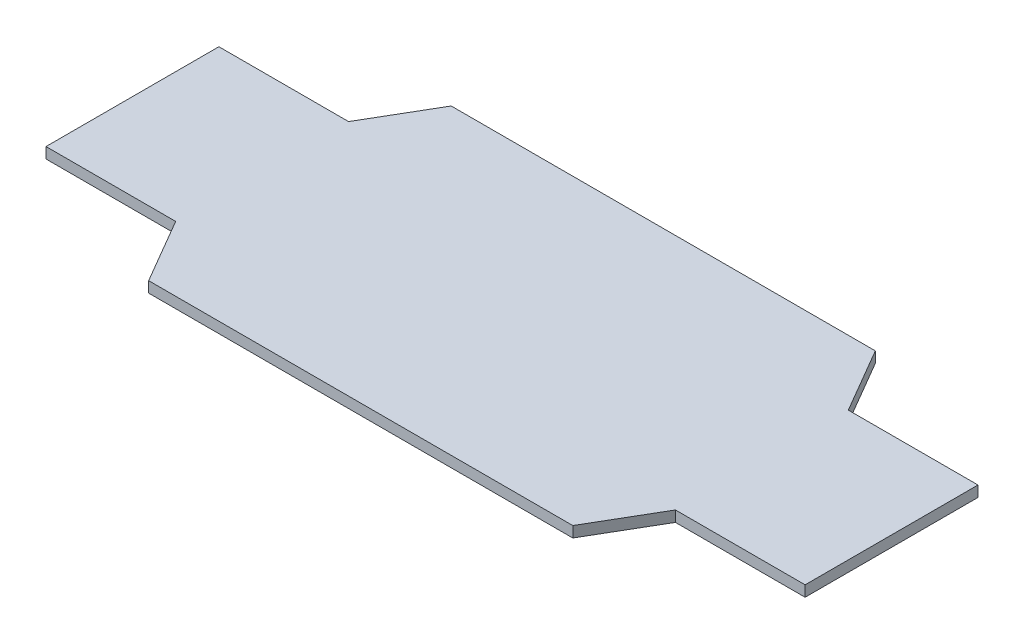
ISO-10303-21;
HEADER;
FILE_DESCRIPTION(('STEP AP214'),'2;1');
FILE_NAME('part.step','',(''),(''),'','','');
FILE_SCHEMA(('AUTOMOTIVE_DESIGN { 1 0 10303 214 1 1 1 1 }'));
ENDSEC;
DATA;
#1=APPLICATION_CONTEXT('core data for automotive mechanical design processes');
#2=APPLICATION_PROTOCOL_DEFINITION('international standard','automotive_design',2000,#1);
#3=PRODUCT_CONTEXT('',#1,'mechanical');
#4=PRODUCT('Part','Part','',(#3));
#5=PRODUCT_RELATED_PRODUCT_CATEGORY('part','',(#4));
#6=PRODUCT_DEFINITION_FORMATION('','',#4);
#7=PRODUCT_DEFINITION_CONTEXT('part definition',#1,'design');
#8=PRODUCT_DEFINITION('design','',#6,#7);
#9=PRODUCT_DEFINITION_SHAPE('','',#8);
#10=(LENGTH_UNIT() NAMED_UNIT(*) SI_UNIT(.MILLI.,.METRE.));
#11=(NAMED_UNIT(*) PLANE_ANGLE_UNIT() SI_UNIT($,.RADIAN.));
#12=(NAMED_UNIT(*) SI_UNIT($,.STERADIAN.) SOLID_ANGLE_UNIT());
#13=UNCERTAINTY_MEASURE_WITH_UNIT(LENGTH_MEASURE(1.E-05),#10,'distance_accuracy_value','');
#14=(GEOMETRIC_REPRESENTATION_CONTEXT(3) GLOBAL_UNCERTAINTY_ASSIGNED_CONTEXT((#13)) GLOBAL_UNIT_ASSIGNED_CONTEXT((#10,
#11,#12)) REPRESENTATION_CONTEXT('',''));
#15=CARTESIAN_POINT('',(0.,0.,0.));
#16=DIRECTION('',(0.,0.,1.));
#17=DIRECTION('',(1.,0.,0.));
#18=AXIS2_PLACEMENT_3D('',#15,#16,#17);
#19=CARTESIAN_POINT('',(0.,5.08,40.64));
#20=DIRECTION('',(0.,0.,-1.));
#21=DIRECTION('',(-1.,0.,0.));
#22=AXIS2_PLACEMENT_3D('',#19,#20,#21);
#23=PLANE('',#22);
#24=DIRECTION('',(1.,0.,0.));
#25=VECTOR('',#24,1.);
#26=CARTESIAN_POINT('',(0.,0.,40.64));
#27=LINE('',#26,#25);
#28=CARTESIAN_POINT('',(117.475,0.,40.64));
#29=VERTEX_POINT('',#28);
#30=CARTESIAN_POINT('',(178.435,0.,40.64));
#31=VERTEX_POINT('',#30);
#32=EDGE_CURVE('E172',#29,#31,#27,.T.);
#33=ORIENTED_EDGE('',*,*,#32,.T.);
#34=DIRECTION('',(0.,-1.,0.));
#35=VECTOR('',#34,1.);
#36=CARTESIAN_POINT('',(178.435,5.08,40.64));
#37=LINE('',#36,#35);
#38=CARTESIAN_POINT('',(178.435,5.08,40.64));
#39=VERTEX_POINT('',#38);
#40=EDGE_CURVE('E11',#39,#31,#37,.T.);
#41=ORIENTED_EDGE('',*,*,#40,.F.);
#42=DIRECTION('',(1.,0.,0.));
#43=VECTOR('',#42,1.);
#44=CARTESIAN_POINT('',(0.,5.08,40.64));
#45=LINE('',#44,#43);
#46=CARTESIAN_POINT('',(117.475,5.08,40.64));
#47=VERTEX_POINT('',#46);
#48=EDGE_CURVE('E206',#47,#39,#45,.T.);
#49=ORIENTED_EDGE('',*,*,#48,.F.);
#50=DIRECTION('',(0.,-1.,0.));
#51=VECTOR('',#50,1.);
#52=CARTESIAN_POINT('',(117.475,5.08,40.64));
#53=LINE('',#52,#51);
#54=EDGE_CURVE('E168',#47,#29,#53,.T.);
#55=ORIENTED_EDGE('',*,*,#54,.T.);
#56=EDGE_LOOP('',(#33,#41,#49,#55));
#57=FACE_BOUND('',#56,.T.);
#58=ADVANCED_FACE('F47',(#57),#23,.F.);
#59=CARTESIAN_POINT('',(178.435,5.08,0.));
#60=DIRECTION('',(-1.,0.,0.));
#61=DIRECTION('',(0.,0.,1.));
#62=AXIS2_PLACEMENT_3D('',#59,#60,#61);
#63=PLANE('',#62);
#64=DIRECTION('',(0.,0.,-1.));
#65=VECTOR('',#64,1.);
#66=CARTESIAN_POINT('',(178.435,0.,0.));
#67=LINE('',#66,#65);
#68=CARTESIAN_POINT('',(178.435,0.,-40.64));
#69=VERTEX_POINT('',#68);
#70=EDGE_CURVE('E176',#31,#69,#67,.T.);
#71=ORIENTED_EDGE('',*,*,#70,.T.);
#72=DIRECTION('',(0.,-1.,0.));
#73=VECTOR('',#72,1.);
#74=CARTESIAN_POINT('',(178.435,5.08,-40.64));
#75=LINE('',#74,#73);
#76=CARTESIAN_POINT('',(178.435,5.08,-40.64));
#77=VERTEX_POINT('',#76);
#78=EDGE_CURVE('E56',#77,#69,#75,.T.);
#79=ORIENTED_EDGE('',*,*,#78,.F.);
#80=DIRECTION('',(0.,0.,-1.));
#81=VECTOR('',#80,1.);
#82=CARTESIAN_POINT('',(178.435,5.08,0.));
#83=LINE('',#82,#81);
#84=EDGE_CURVE('E119',#39,#77,#83,.T.);
#85=ORIENTED_EDGE('',*,*,#84,.F.);
#86=ORIENTED_EDGE('',*,*,#40,.T.);
#87=EDGE_LOOP('',(#71,#79,#85,#86));
#88=FACE_BOUND('',#87,.T.);
#89=ADVANCED_FACE('F300',(#88),#63,.F.);
#90=CARTESIAN_POINT('',(0.,5.08,-40.64));
#91=DIRECTION('',(0.,0.,1.));
#92=DIRECTION('',(1.,0.,0.));
#93=AXIS2_PLACEMENT_3D('',#90,#91,#92);
#94=PLANE('',#93);
#95=DIRECTION('',(-1.,0.,0.));
#96=VECTOR('',#95,1.);
#97=CARTESIAN_POINT('',(0.,0.,-40.64));
#98=LINE('',#97,#96);
#99=CARTESIAN_POINT('',(117.475,0.,-40.64));
#100=VERTEX_POINT('',#99);
#101=EDGE_CURVE('E179',#69,#100,#98,.T.);
#102=ORIENTED_EDGE('',*,*,#101,.T.);
#103=DIRECTION('',(0.,-1.,0.));
#104=VECTOR('',#103,1.);
#105=CARTESIAN_POINT('',(117.475,5.08,-40.64));
#106=LINE('',#105,#104);
#107=CARTESIAN_POINT('',(117.475,5.08,-40.64));
#108=VERTEX_POINT('',#107);
#109=EDGE_CURVE('E233',#108,#100,#106,.T.);
#110=ORIENTED_EDGE('',*,*,#109,.F.);
#111=DIRECTION('',(-1.,0.,0.));
#112=VECTOR('',#111,1.);
#113=CARTESIAN_POINT('',(0.,5.08,-40.64));
#114=LINE('',#113,#112);
#115=EDGE_CURVE('E243',#77,#108,#114,.T.);
#116=ORIENTED_EDGE('',*,*,#115,.F.);
#117=ORIENTED_EDGE('',*,*,#78,.T.);
#118=EDGE_LOOP('',(#102,#110,#116,#117));
#119=FACE_BOUND('',#118,.T.);
#120=ADVANCED_FACE('F241',(#119),#94,.F.);
#121=CARTESIAN_POINT('',(105.337616580311,5.08,-61.4469430051814));
#122=DIRECTION('',(-0.863778900898433,0.,0.503871025524086));
#123=DIRECTION('',(0.503871025524086,0.,0.863778900898433));
#124=AXIS2_PLACEMENT_3D('',#121,#122,#123);
#125=PLANE('',#124);
#126=DIRECTION('',(-0.503871025524086,0.,-0.863778900898433));
#127=VECTOR('',#126,1.);
#128=CARTESIAN_POINT('',(105.337616580311,0.,-61.4469430051814));
#129=LINE('',#128,#127);
#130=CARTESIAN_POINT('',(99.695,0.,-71.12));
#131=VERTEX_POINT('',#130);
#132=EDGE_CURVE('E182',#100,#131,#129,.T.);
#133=ORIENTED_EDGE('',*,*,#132,.T.);
#134=DIRECTION('',(0.,-1.,0.));
#135=VECTOR('',#134,1.);
#136=CARTESIAN_POINT('',(99.695,5.08,-71.12));
#137=LINE('',#136,#135);
#138=CARTESIAN_POINT('',(99.695,5.08,-71.12));
#139=VERTEX_POINT('',#138);
#140=EDGE_CURVE('E229',#139,#131,#137,.T.);
#141=ORIENTED_EDGE('',*,*,#140,.F.);
#142=DIRECTION('',(-0.503871025524086,0.,-0.863778900898433));
#143=VECTOR('',#142,1.);
#144=CARTESIAN_POINT('',(105.337616580311,5.08,-61.4469430051814));
#145=LINE('',#144,#143);
#146=EDGE_CURVE('E262',#108,#139,#145,.T.);
#147=ORIENTED_EDGE('',*,*,#146,.F.);
#148=ORIENTED_EDGE('',*,*,#109,.T.);
#149=EDGE_LOOP('',(#133,#141,#147,#148));
#150=FACE_BOUND('',#149,.T.);
#151=ADVANCED_FACE('F252',(#150),#125,.F.);
#152=CARTESIAN_POINT('',(0.,5.08,-71.12));
#153=DIRECTION('',(0.,0.,1.));
#154=DIRECTION('',(1.,0.,0.));
#155=AXIS2_PLACEMENT_3D('',#152,#153,#154);
#156=PLANE('',#155);
#157=DIRECTION('',(-1.,0.,0.));
#158=VECTOR('',#157,1.);
#159=CARTESIAN_POINT('',(0.,0.,-71.12));
#160=LINE('',#159,#158);
#161=CARTESIAN_POINT('',(-99.695,0.,-71.12));
#162=VERTEX_POINT('',#161);
#163=EDGE_CURVE('E185',#131,#162,#160,.T.);
#164=ORIENTED_EDGE('',*,*,#163,.T.);
#165=DIRECTION('',(0.,-1.,0.));
#166=VECTOR('',#165,1.);
#167=CARTESIAN_POINT('',(-99.695,5.08,-71.12));
#168=LINE('',#167,#166);
#169=CARTESIAN_POINT('',(-99.695,5.08,-71.12));
#170=VERTEX_POINT('',#169);
#171=EDGE_CURVE('E225',#170,#162,#168,.T.);
#172=ORIENTED_EDGE('',*,*,#171,.F.);
#173=DIRECTION('',(-1.,0.,0.));
#174=VECTOR('',#173,1.);
#175=CARTESIAN_POINT('',(0.,5.08,-71.12));
#176=LINE('',#175,#174);
#177=EDGE_CURVE('E258',#139,#170,#176,.T.);
#178=ORIENTED_EDGE('',*,*,#177,.F.);
#179=ORIENTED_EDGE('',*,*,#140,.T.);
#180=EDGE_LOOP('',(#164,#172,#178,#179));
#181=FACE_BOUND('',#180,.T.);
#182=ADVANCED_FACE('F256',(#181),#156,.F.);
#183=CARTESIAN_POINT('',(-105.337616580311,5.08,-61.4469430051814));
#184=DIRECTION('',(0.863778900898433,0.,0.503871025524086));
#185=DIRECTION('',(0.503871025524086,0.,-0.863778900898433));
#186=AXIS2_PLACEMENT_3D('',#183,#184,#185);
#187=PLANE('',#186);
#188=DIRECTION('',(-0.503871025524086,0.,0.863778900898433));
#189=VECTOR('',#188,1.);
#190=CARTESIAN_POINT('',(-105.337616580311,0.,-61.4469430051814));
#191=LINE('',#190,#189);
#192=CARTESIAN_POINT('',(-117.475,0.,-40.64));
#193=VERTEX_POINT('',#192);
#194=EDGE_CURVE('E188',#162,#193,#191,.T.);
#195=ORIENTED_EDGE('',*,*,#194,.T.);
#196=DIRECTION('',(0.,-1.,0.));
#197=VECTOR('',#196,1.);
#198=CARTESIAN_POINT('',(-117.475,5.08,-40.64));
#199=LINE('',#198,#197);
#200=CARTESIAN_POINT('',(-117.475,5.08,-40.64));
#201=VERTEX_POINT('',#200);
#202=EDGE_CURVE('E221',#201,#193,#199,.T.);
#203=ORIENTED_EDGE('',*,*,#202,.F.);
#204=DIRECTION('',(-0.503871025524086,0.,0.863778900898433));
#205=VECTOR('',#204,1.);
#206=CARTESIAN_POINT('',(-105.337616580311,5.08,-61.4469430051814));
#207=LINE('',#206,#205);
#208=EDGE_CURVE('E261',#170,#201,#207,.T.);
#209=ORIENTED_EDGE('',*,*,#208,.F.);
#210=ORIENTED_EDGE('',*,*,#171,.T.);
#211=EDGE_LOOP('',(#195,#203,#209,#210));
#212=FACE_BOUND('',#211,.T.);
#213=ADVANCED_FACE('F313',(#212),#187,.F.);
#214=CARTESIAN_POINT('',(0.,5.08,-40.64));
#215=DIRECTION('',(0.,0.,1.));
#216=DIRECTION('',(1.,0.,0.));
#217=AXIS2_PLACEMENT_3D('',#214,#215,#216);
#218=PLANE('',#217);
#219=DIRECTION('',(-1.,0.,0.));
#220=VECTOR('',#219,1.);
#221=CARTESIAN_POINT('',(0.,0.,-40.64));
#222=LINE('',#221,#220);
#223=CARTESIAN_POINT('',(-178.435,0.,-40.64));
#224=VERTEX_POINT('',#223);
#225=EDGE_CURVE('E191',#193,#224,#222,.T.);
#226=ORIENTED_EDGE('',*,*,#225,.T.);
#227=DIRECTION('',(0.,-1.,0.));
#228=VECTOR('',#227,1.);
#229=CARTESIAN_POINT('',(-178.435,5.08,-40.64));
#230=LINE('',#229,#228);
#231=CARTESIAN_POINT('',(-178.435,5.08,-40.64));
#232=VERTEX_POINT('',#231);
#233=EDGE_CURVE('E217',#232,#224,#230,.T.);
#234=ORIENTED_EDGE('',*,*,#233,.F.);
#235=DIRECTION('',(-1.,0.,0.));
#236=VECTOR('',#235,1.);
#237=CARTESIAN_POINT('',(0.,5.08,-40.64));
#238=LINE('',#237,#236);
#239=EDGE_CURVE('E266',#201,#232,#238,.T.);
#240=ORIENTED_EDGE('',*,*,#239,.F.);
#241=ORIENTED_EDGE('',*,*,#202,.T.);
#242=EDGE_LOOP('',(#226,#234,#240,#241));
#243=FACE_BOUND('',#242,.T.);
#244=ADVANCED_FACE('F316',(#243),#218,.F.);
#245=CARTESIAN_POINT('',(-178.435,5.08,0.));
#246=DIRECTION('',(1.,0.,0.));
#247=DIRECTION('',(0.,0.,-1.));
#248=AXIS2_PLACEMENT_3D('',#245,#246,#247);
#249=PLANE('',#248);
#250=DIRECTION('',(0.,0.,1.));
#251=VECTOR('',#250,1.);
#252=CARTESIAN_POINT('',(-178.435,0.,0.));
#253=LINE('',#252,#251);
#254=CARTESIAN_POINT('',(-178.435,0.,40.64));
#255=VERTEX_POINT('',#254);
#256=EDGE_CURVE('E194',#224,#255,#253,.T.);
#257=ORIENTED_EDGE('',*,*,#256,.T.);
#258=DIRECTION('',(0.,-1.,0.));
#259=VECTOR('',#258,1.);
#260=CARTESIAN_POINT('',(-178.435,5.08,40.64));
#261=LINE('',#260,#259);
#262=CARTESIAN_POINT('',(-178.435,5.08,40.64));
#263=VERTEX_POINT('',#262);
#264=EDGE_CURVE('E213',#263,#255,#261,.T.);
#265=ORIENTED_EDGE('',*,*,#264,.F.);
#266=DIRECTION('',(0.,0.,1.));
#267=VECTOR('',#266,1.);
#268=CARTESIAN_POINT('',(-178.435,5.08,0.));
#269=LINE('',#268,#267);
#270=EDGE_CURVE('E273',#232,#263,#269,.T.);
#271=ORIENTED_EDGE('',*,*,#270,.F.);
#272=ORIENTED_EDGE('',*,*,#233,.T.);
#273=EDGE_LOOP('',(#257,#265,#271,#272));
#274=FACE_BOUND('',#273,.T.);
#275=ADVANCED_FACE('F281',(#274),#249,.F.);
#276=CARTESIAN_POINT('',(0.,5.08,40.64));
#277=DIRECTION('',(0.,0.,-1.));
#278=DIRECTION('',(-1.,0.,0.));
#279=AXIS2_PLACEMENT_3D('',#276,#277,#278);
#280=PLANE('',#279);
#281=DIRECTION('',(1.,0.,0.));
#282=VECTOR('',#281,1.);
#283=CARTESIAN_POINT('',(0.,0.,40.64));
#284=LINE('',#283,#282);
#285=CARTESIAN_POINT('',(-117.475,0.,40.64));
#286=VERTEX_POINT('',#285);
#287=EDGE_CURVE('E197',#255,#286,#284,.T.);
#288=ORIENTED_EDGE('',*,*,#287,.T.);
#289=DIRECTION('',(0.,-1.,0.));
#290=VECTOR('',#289,1.);
#291=CARTESIAN_POINT('',(-117.475,5.08,40.64));
#292=LINE('',#291,#290);
#293=CARTESIAN_POINT('',(-117.475,5.08,40.64));
#294=VERTEX_POINT('',#293);
#295=EDGE_CURVE('E161',#294,#286,#292,.T.);
#296=ORIENTED_EDGE('',*,*,#295,.F.);
#297=DIRECTION('',(1.,0.,0.));
#298=VECTOR('',#297,1.);
#299=CARTESIAN_POINT('',(0.,5.08,40.64));
#300=LINE('',#299,#298);
#301=EDGE_CURVE('E150',#263,#294,#300,.T.);
#302=ORIENTED_EDGE('',*,*,#301,.F.);
#303=ORIENTED_EDGE('',*,*,#264,.T.);
#304=EDGE_LOOP('',(#288,#296,#302,#303));
#305=FACE_BOUND('',#304,.T.);
#306=ADVANCED_FACE('F285',(#305),#280,.F.);
#307=CARTESIAN_POINT('',(-105.337616580311,5.08,61.4469430051814));
#308=DIRECTION('',(0.863778900898433,0.,-0.503871025524087));
#309=DIRECTION('',(-0.503871025524087,0.,-0.863778900898433));
#310=AXIS2_PLACEMENT_3D('',#307,#308,#309);
#311=PLANE('',#310);
#312=DIRECTION('',(0.503871025524087,0.,0.863778900898433));
#313=VECTOR('',#312,1.);
#314=CARTESIAN_POINT('',(-105.337616580311,0.,61.4469430051814));
#315=LINE('',#314,#313);
#316=CARTESIAN_POINT('',(-99.695,0.,71.12));
#317=VERTEX_POINT('',#316);
#318=EDGE_CURVE('E159',#286,#317,#315,.T.);
#319=ORIENTED_EDGE('',*,*,#318,.T.);
#320=DIRECTION('',(0.,-1.,0.));
#321=VECTOR('',#320,1.);
#322=CARTESIAN_POINT('',(-99.695,5.08,71.12));
#323=LINE('',#322,#321);
#324=CARTESIAN_POINT('',(-99.695,5.08,71.12));
#325=VERTEX_POINT('',#324);
#326=EDGE_CURVE('E156',#325,#317,#323,.T.);
#327=ORIENTED_EDGE('',*,*,#326,.F.);
#328=DIRECTION('',(0.503871025524087,0.,0.863778900898433));
#329=VECTOR('',#328,1.);
#330=CARTESIAN_POINT('',(-105.337616580311,5.08,61.4469430051814));
#331=LINE('',#330,#329);
#332=EDGE_CURVE('E144',#294,#325,#331,.T.);
#333=ORIENTED_EDGE('',*,*,#332,.F.);
#334=ORIENTED_EDGE('',*,*,#295,.T.);
#335=EDGE_LOOP('',(#319,#327,#333,#334));
#336=FACE_BOUND('',#335,.T.);
#337=ADVANCED_FACE('F157',(#336),#311,.F.);
#338=CARTESIAN_POINT('',(0.,5.08,71.12));
#339=DIRECTION('',(0.,0.,-1.));
#340=DIRECTION('',(-1.,0.,0.));
#341=AXIS2_PLACEMENT_3D('',#338,#339,#340);
#342=PLANE('',#341);
#343=DIRECTION('',(1.,0.,0.));
#344=VECTOR('',#343,1.);
#345=CARTESIAN_POINT('',(0.,0.,71.12));
#346=LINE('',#345,#344);
#347=CARTESIAN_POINT('',(99.695,0.,71.12));
#348=VERTEX_POINT('',#347);
#349=EDGE_CURVE('E105',#317,#348,#346,.T.);
#350=ORIENTED_EDGE('',*,*,#349,.T.);
#351=DIRECTION('',(0.,-1.,0.));
#352=VECTOR('',#351,1.);
#353=CARTESIAN_POINT('',(99.695,5.08,71.12));
#354=LINE('',#353,#352);
#355=CARTESIAN_POINT('',(99.695,5.08,71.12));
#356=VERTEX_POINT('',#355);
#357=EDGE_CURVE('E162',#356,#348,#354,.T.);
#358=ORIENTED_EDGE('',*,*,#357,.F.);
#359=DIRECTION('',(1.,0.,0.));
#360=VECTOR('',#359,1.);
#361=CARTESIAN_POINT('',(0.,5.08,71.12));
#362=LINE('',#361,#360);
#363=EDGE_CURVE('E148',#325,#356,#362,.T.);
#364=ORIENTED_EDGE('',*,*,#363,.F.);
#365=ORIENTED_EDGE('',*,*,#326,.T.);
#366=EDGE_LOOP('',(#350,#358,#364,#365));
#367=FACE_BOUND('',#366,.T.);
#368=ADVANCED_FACE('F164',(#367),#342,.F.);
#369=CARTESIAN_POINT('',(105.337616580311,5.08,61.4469430051814));
#370=DIRECTION('',(-0.863778900898433,0.,-0.503871025524087));
#371=DIRECTION('',(-0.503871025524087,0.,0.863778900898433));
#372=AXIS2_PLACEMENT_3D('',#369,#370,#371);
#373=PLANE('',#372);
#374=DIRECTION('',(0.503871025524087,0.,-0.863778900898433));
#375=VECTOR('',#374,1.);
#376=CARTESIAN_POINT('',(105.337616580311,0.,61.4469430051814));
#377=LINE('',#376,#375);
#378=EDGE_CURVE('E111',#348,#29,#377,.T.);
#379=ORIENTED_EDGE('',*,*,#378,.T.);
#380=ORIENTED_EDGE('',*,*,#54,.F.);
#381=DIRECTION('',(0.503871025524087,0.,-0.863778900898433));
#382=VECTOR('',#381,1.);
#383=CARTESIAN_POINT('',(105.337616580311,5.08,61.4469430051814));
#384=LINE('',#383,#382);
#385=EDGE_CURVE('E64',#356,#47,#384,.T.);
#386=ORIENTED_EDGE('',*,*,#385,.F.);
#387=ORIENTED_EDGE('',*,*,#357,.T.);
#388=EDGE_LOOP('',(#379,#380,#386,#387));
#389=FACE_BOUND('',#388,.T.);
#390=ADVANCED_FACE('F289',(#389),#373,.F.);
#391=CARTESIAN_POINT('',(0.,5.08,0.));
#392=DIRECTION('',(0.,1.,0.));
#393=DIRECTION('',(0.,0.,1.));
#394=AXIS2_PLACEMENT_3D('',#391,#392,#393);
#395=PLANE('',#394);
#396=ORIENTED_EDGE('',*,*,#48,.T.);
#397=ORIENTED_EDGE('',*,*,#84,.T.);
#398=ORIENTED_EDGE('',*,*,#115,.T.);
#399=ORIENTED_EDGE('',*,*,#146,.T.);
#400=ORIENTED_EDGE('',*,*,#177,.T.);
#401=ORIENTED_EDGE('',*,*,#208,.T.);
#402=ORIENTED_EDGE('',*,*,#239,.T.);
#403=ORIENTED_EDGE('',*,*,#270,.T.);
#404=ORIENTED_EDGE('',*,*,#301,.T.);
#405=ORIENTED_EDGE('',*,*,#332,.T.);
#406=ORIENTED_EDGE('',*,*,#363,.T.);
#407=ORIENTED_EDGE('',*,*,#385,.T.);
#408=EDGE_LOOP('',(#396,#397,#398,#399,#400,#401,#402,#403,#404,#405,#406,#407));
#409=FACE_BOUND('',#408,.T.);
#410=ADVANCED_FACE('F146',(#409),#395,.T.);
#411=CARTESIAN_POINT('',(0.,0.,0.));
#412=DIRECTION('',(0.,1.,0.));
#413=DIRECTION('',(0.,0.,1.));
#414=AXIS2_PLACEMENT_3D('',#411,#412,#413);
#415=PLANE('',#414);
#416=ORIENTED_EDGE('',*,*,#32,.F.);
#417=ORIENTED_EDGE('',*,*,#378,.F.);
#418=ORIENTED_EDGE('',*,*,#349,.F.);
#419=ORIENTED_EDGE('',*,*,#318,.F.);
#420=ORIENTED_EDGE('',*,*,#287,.F.);
#421=ORIENTED_EDGE('',*,*,#256,.F.);
#422=ORIENTED_EDGE('',*,*,#225,.F.);
#423=ORIENTED_EDGE('',*,*,#194,.F.);
#424=ORIENTED_EDGE('',*,*,#163,.F.);
#425=ORIENTED_EDGE('',*,*,#132,.F.);
#426=ORIENTED_EDGE('',*,*,#101,.F.);
#427=ORIENTED_EDGE('',*,*,#70,.F.);
#428=EDGE_LOOP('',(#416,#417,#418,#419,#420,#421,#422,#423,#424,#425,#426,#427));
#429=FACE_BOUND('',#428,.T.);
#430=ADVANCED_FACE('F247',(#429),#415,.F.);
#431=CLOSED_SHELL('',(#58,#89,#120,#151,#182,#213,#244,#275,#306,#337,#368,#390,#410,#430));
#432=MANIFOLD_SOLID_BREP('B2',#431);
#433=ADVANCED_BREP_SHAPE_REPRESENTATION('',(#18,#432),#14);
#434=SHAPE_DEFINITION_REPRESENTATION(#9,#433);
ENDSEC;
END-ISO-10303-21;
